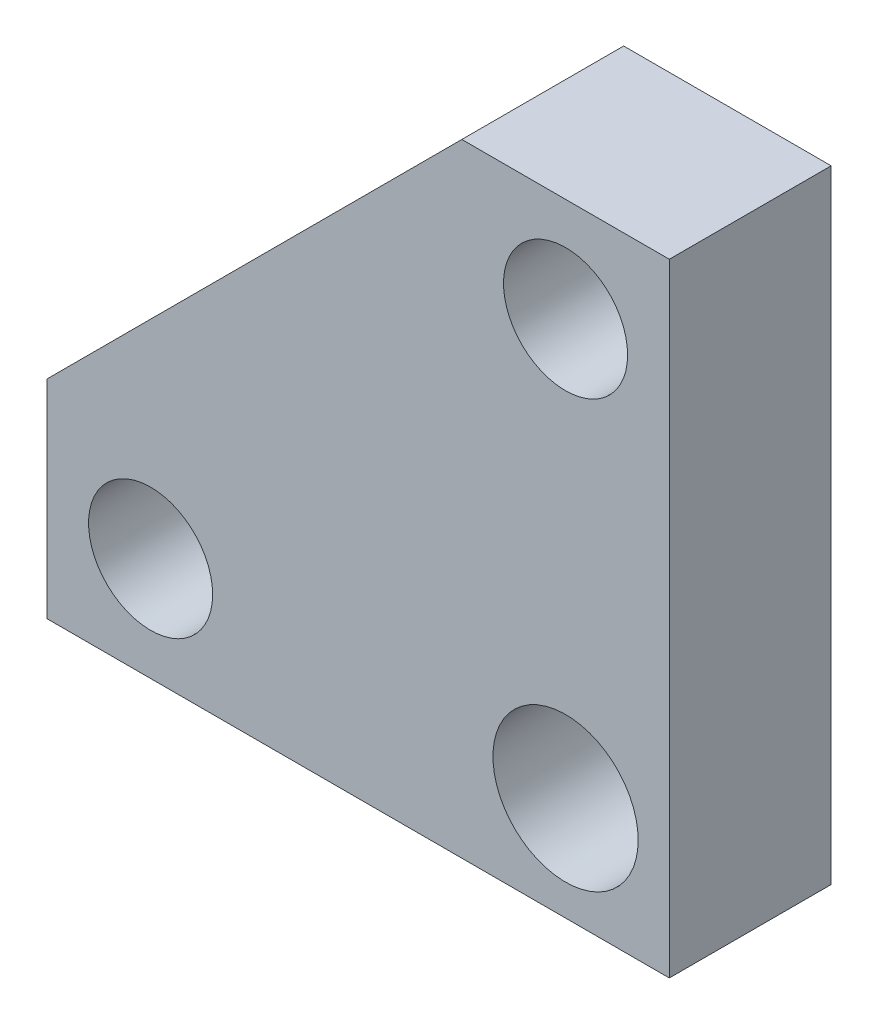
ISO-10303-21;
HEADER;
FILE_DESCRIPTION(('STEP AP214'),'2;1');
FILE_NAME('part.step','',(''),(''),'','','');
FILE_SCHEMA(('AUTOMOTIVE_DESIGN { 1 0 10303 214 1 1 1 1 }'));
ENDSEC;
DATA;
#1=APPLICATION_CONTEXT('core data for automotive mechanical design processes');
#2=APPLICATION_PROTOCOL_DEFINITION('international standard','automotive_design',2000,#1);
#3=PRODUCT_CONTEXT('',#1,'mechanical');
#4=PRODUCT('Part','Part','',(#3));
#5=PRODUCT_RELATED_PRODUCT_CATEGORY('part','',(#4));
#6=PRODUCT_DEFINITION_FORMATION('','',#4);
#7=PRODUCT_DEFINITION_CONTEXT('part definition',#1,'design');
#8=PRODUCT_DEFINITION('design','',#6,#7);
#9=PRODUCT_DEFINITION_SHAPE('','',#8);
#10=(LENGTH_UNIT() NAMED_UNIT(*) SI_UNIT(.MILLI.,.METRE.));
#11=(NAMED_UNIT(*) PLANE_ANGLE_UNIT() SI_UNIT($,.RADIAN.));
#12=(NAMED_UNIT(*) SI_UNIT($,.STERADIAN.) SOLID_ANGLE_UNIT());
#13=UNCERTAINTY_MEASURE_WITH_UNIT(LENGTH_MEASURE(1.E-05),#10,'distance_accuracy_value','');
#14=(GEOMETRIC_REPRESENTATION_CONTEXT(3) GLOBAL_UNCERTAINTY_ASSIGNED_CONTEXT((#13)) GLOBAL_UNIT_ASSIGNED_CONTEXT((#10,
#11,#12)) REPRESENTATION_CONTEXT('',''));
#15=CARTESIAN_POINT('',(0.,0.,0.));
#16=DIRECTION('',(0.,0.,1.));
#17=DIRECTION('',(1.,0.,0.));
#18=AXIS2_PLACEMENT_3D('',#15,#16,#17);
#19=CARTESIAN_POINT('',(0.,0.,3.9));
#20=DIRECTION('',(0.,0.,1.));
#21=DIRECTION('',(1.,0.,0.));
#22=AXIS2_PLACEMENT_3D('',#19,#20,#21);
#23=PLANE('',#22);
#24=CARTESIAN_POINT('',(-25.,5.,3.9));
#25=DIRECTION('',(0.,0.,1.));
#26=DIRECTION('',(1.,0.,0.));
#27=AXIS2_PLACEMENT_3D('',#24,#25,#26);
#28=CIRCLE('',#27,2.99);
#29=CARTESIAN_POINT('',(-22.01,5.,3.9));
#30=VERTEX_POINT('',#29);
#31=EDGE_CURVE('E141',#30,#30,#28,.T.);
#32=ORIENTED_EDGE('',*,*,#31,.F.);
#33=EDGE_LOOP('',(#32));
#34=FACE_BOUND('',#33,.T.);
#35=DIRECTION('',(1.,0.,0.));
#36=VECTOR('',#35,1.);
#37=CARTESIAN_POINT('',(-30.,0.,3.9));
#38=LINE('',#37,#36);
#39=CARTESIAN_POINT('',(-30.,0.,3.9));
#40=VERTEX_POINT('',#39);
#41=CARTESIAN_POINT('',(0.,0.,3.9));
#42=VERTEX_POINT('',#41);
#43=EDGE_CURVE('E110',#40,#42,#38,.T.);
#44=ORIENTED_EDGE('',*,*,#43,.T.);
#45=DIRECTION('',(0.,1.,0.));
#46=VECTOR('',#45,1.);
#47=CARTESIAN_POINT('',(0.,0.,3.9));
#48=LINE('',#47,#46);
#49=CARTESIAN_POINT('',(0.,30.,3.9));
#50=VERTEX_POINT('',#49);
#51=EDGE_CURVE('E93',#42,#50,#48,.T.);
#52=ORIENTED_EDGE('',*,*,#51,.T.);
#53=DIRECTION('',(-1.,0.,0.));
#54=VECTOR('',#53,1.);
#55=CARTESIAN_POINT('',(0.,30.,3.9));
#56=LINE('',#55,#54);
#57=CARTESIAN_POINT('',(-10.,30.,3.9));
#58=VERTEX_POINT('',#57);
#59=EDGE_CURVE('E113',#50,#58,#56,.T.);
#60=ORIENTED_EDGE('',*,*,#59,.T.);
#61=DIRECTION('',(-0.707106781186548,-0.707106781186548,0.));
#62=VECTOR('',#61,1.);
#63=CARTESIAN_POINT('',(-10.,30.,3.9));
#64=LINE('',#63,#62);
#65=CARTESIAN_POINT('',(-30.,10.,3.9));
#66=VERTEX_POINT('',#65);
#67=EDGE_CURVE('E52',#58,#66,#64,.T.);
#68=ORIENTED_EDGE('',*,*,#67,.T.);
#69=DIRECTION('',(0.,-1.,0.));
#70=VECTOR('',#69,1.);
#71=CARTESIAN_POINT('',(-30.,10.,3.9));
#72=LINE('',#71,#70);
#73=EDGE_CURVE('E47',#66,#40,#72,.T.);
#74=ORIENTED_EDGE('',*,*,#73,.T.);
#75=EDGE_LOOP('',(#44,#52,#60,#68,#74));
#76=FACE_BOUND('',#75,.T.);
#77=CARTESIAN_POINT('',(-5.,25.,3.9));
#78=DIRECTION('',(0.,0.,1.));
#79=DIRECTION('',(1.,0.,0.));
#80=AXIS2_PLACEMENT_3D('',#77,#78,#79);
#81=CIRCLE('',#80,2.99);
#82=CARTESIAN_POINT('',(-2.01,25.,3.9));
#83=VERTEX_POINT('',#82);
#84=EDGE_CURVE('E98',#83,#83,#81,.T.);
#85=ORIENTED_EDGE('',*,*,#84,.F.);
#86=EDGE_LOOP('',(#85));
#87=FACE_BOUND('',#86,.T.);
#88=CARTESIAN_POINT('',(-5.,5.,3.9));
#89=DIRECTION('',(0.,0.,1.));
#90=DIRECTION('',(1.,0.,0.));
#91=AXIS2_PLACEMENT_3D('',#88,#89,#90);
#92=CIRCLE('',#91,3.5);
#93=CARTESIAN_POINT('',(-1.5,5.,3.9));
#94=VERTEX_POINT('',#93);
#95=EDGE_CURVE('E135',#94,#94,#92,.T.);
#96=ORIENTED_EDGE('',*,*,#95,.F.);
#97=EDGE_LOOP('',(#96));
#98=FACE_BOUND('',#97,.T.);
#99=ADVANCED_FACE('F32',(#34,#76,#87,#98),#23,.T.);
#100=CARTESIAN_POINT('',(0.,0.,-3.9));
#101=DIRECTION('',(0.,0.,1.));
#102=DIRECTION('',(1.,0.,0.));
#103=AXIS2_PLACEMENT_3D('',#100,#101,#102);
#104=PLANE('',#103);
#105=CARTESIAN_POINT('',(-25.,5.,-3.9));
#106=DIRECTION('',(0.,0.,1.));
#107=DIRECTION('',(1.,0.,0.));
#108=AXIS2_PLACEMENT_3D('',#105,#106,#107);
#109=CIRCLE('',#108,2.99);
#110=CARTESIAN_POINT('',(-22.01,5.,-3.9));
#111=VERTEX_POINT('',#110);
#112=EDGE_CURVE('E137',#111,#111,#109,.T.);
#113=ORIENTED_EDGE('',*,*,#112,.T.);
#114=EDGE_LOOP('',(#113));
#115=FACE_BOUND('',#114,.T.);
#116=DIRECTION('',(1.,0.,0.));
#117=VECTOR('',#116,1.);
#118=CARTESIAN_POINT('',(-30.,0.,-3.9));
#119=LINE('',#118,#117);
#120=CARTESIAN_POINT('',(-30.,0.,-3.9));
#121=VERTEX_POINT('',#120);
#122=CARTESIAN_POINT('',(0.,0.,-3.9));
#123=VERTEX_POINT('',#122);
#124=EDGE_CURVE('E84',#121,#123,#119,.T.);
#125=ORIENTED_EDGE('',*,*,#124,.F.);
#126=DIRECTION('',(0.,-1.,0.));
#127=VECTOR('',#126,1.);
#128=CARTESIAN_POINT('',(-30.,10.,-3.9));
#129=LINE('',#128,#127);
#130=CARTESIAN_POINT('',(-30.,10.,-3.9));
#131=VERTEX_POINT('',#130);
#132=EDGE_CURVE('E108',#131,#121,#129,.T.);
#133=ORIENTED_EDGE('',*,*,#132,.F.);
#134=DIRECTION('',(-0.707106781186548,-0.707106781186548,0.));
#135=VECTOR('',#134,1.);
#136=CARTESIAN_POINT('',(-10.,30.,-3.9));
#137=LINE('',#136,#135);
#138=CARTESIAN_POINT('',(-10.,30.,-3.9));
#139=VERTEX_POINT('',#138);
#140=EDGE_CURVE('E106',#139,#131,#137,.T.);
#141=ORIENTED_EDGE('',*,*,#140,.F.);
#142=DIRECTION('',(-1.,0.,0.));
#143=VECTOR('',#142,1.);
#144=CARTESIAN_POINT('',(0.,30.,-3.9));
#145=LINE('',#144,#143);
#146=CARTESIAN_POINT('',(0.,30.,-3.9));
#147=VERTEX_POINT('',#146);
#148=EDGE_CURVE('E86',#147,#139,#145,.T.);
#149=ORIENTED_EDGE('',*,*,#148,.F.);
#150=DIRECTION('',(0.,1.,0.));
#151=VECTOR('',#150,1.);
#152=CARTESIAN_POINT('',(0.,0.,-3.9));
#153=LINE('',#152,#151);
#154=EDGE_CURVE('E79',#123,#147,#153,.T.);
#155=ORIENTED_EDGE('',*,*,#154,.F.);
#156=EDGE_LOOP('',(#125,#133,#141,#149,#155));
#157=FACE_BOUND('',#156,.T.);
#158=CARTESIAN_POINT('',(-5.,25.,-3.9));
#159=DIRECTION('',(0.,0.,1.));
#160=DIRECTION('',(1.,0.,0.));
#161=AXIS2_PLACEMENT_3D('',#158,#159,#160);
#162=CIRCLE('',#161,2.99);
#163=CARTESIAN_POINT('',(-2.01,25.,-3.9));
#164=VERTEX_POINT('',#163);
#165=EDGE_CURVE('E101',#164,#164,#162,.T.);
#166=ORIENTED_EDGE('',*,*,#165,.T.);
#167=EDGE_LOOP('',(#166));
#168=FACE_BOUND('',#167,.T.);
#169=CARTESIAN_POINT('',(-5.,5.,-3.9));
#170=DIRECTION('',(0.,0.,1.));
#171=DIRECTION('',(1.,0.,0.));
#172=AXIS2_PLACEMENT_3D('',#169,#170,#171);
#173=CIRCLE('',#172,3.5);
#174=CARTESIAN_POINT('',(-1.5,5.,-3.9));
#175=VERTEX_POINT('',#174);
#176=EDGE_CURVE('E138',#175,#175,#173,.T.);
#177=ORIENTED_EDGE('',*,*,#176,.T.);
#178=EDGE_LOOP('',(#177));
#179=FACE_BOUND('',#178,.T.);
#180=ADVANCED_FACE('F80',(#115,#157,#168,#179),#104,.F.);
#181=CARTESIAN_POINT('',(-30.,0.,3.9));
#182=DIRECTION('',(0.,1.,0.));
#183=DIRECTION('',(0.,0.,1.));
#184=AXIS2_PLACEMENT_3D('',#181,#182,#183);
#185=PLANE('',#184);
#186=ORIENTED_EDGE('',*,*,#124,.T.);
#187=DIRECTION('',(0.,0.,-1.));
#188=VECTOR('',#187,1.);
#189=CARTESIAN_POINT('',(0.,0.,3.9));
#190=LINE('',#189,#188);
#191=EDGE_CURVE('E11',#42,#123,#190,.T.);
#192=ORIENTED_EDGE('',*,*,#191,.F.);
#193=ORIENTED_EDGE('',*,*,#43,.F.);
#194=DIRECTION('',(0.,0.,-1.));
#195=VECTOR('',#194,1.);
#196=CARTESIAN_POINT('',(-30.,0.,3.9));
#197=LINE('',#196,#195);
#198=EDGE_CURVE('E97',#40,#121,#197,.T.);
#199=ORIENTED_EDGE('',*,*,#198,.T.);
#200=EDGE_LOOP('',(#186,#192,#193,#199));
#201=FACE_BOUND('',#200,.T.);
#202=ADVANCED_FACE('F34',(#201),#185,.F.);
#203=CARTESIAN_POINT('',(0.,0.,3.9));
#204=DIRECTION('',(-1.,0.,0.));
#205=DIRECTION('',(0.,0.,1.));
#206=AXIS2_PLACEMENT_3D('',#203,#204,#205);
#207=PLANE('',#206);
#208=ORIENTED_EDGE('',*,*,#154,.T.);
#209=DIRECTION('',(0.,0.,-1.));
#210=VECTOR('',#209,1.);
#211=CARTESIAN_POINT('',(0.,30.,3.9));
#212=LINE('',#211,#210);
#213=EDGE_CURVE('E40',#50,#147,#212,.T.);
#214=ORIENTED_EDGE('',*,*,#213,.F.);
#215=ORIENTED_EDGE('',*,*,#51,.F.);
#216=ORIENTED_EDGE('',*,*,#191,.T.);
#217=EDGE_LOOP('',(#208,#214,#215,#216));
#218=FACE_BOUND('',#217,.T.);
#219=ADVANCED_FACE('F92',(#218),#207,.F.);
#220=CARTESIAN_POINT('',(0.,30.,3.9));
#221=DIRECTION('',(0.,-1.,0.));
#222=DIRECTION('',(0.,0.,-1.));
#223=AXIS2_PLACEMENT_3D('',#220,#221,#222);
#224=PLANE('',#223);
#225=ORIENTED_EDGE('',*,*,#148,.T.);
#226=DIRECTION('',(0.,0.,-1.));
#227=VECTOR('',#226,1.);
#228=CARTESIAN_POINT('',(-10.,30.,3.9));
#229=LINE('',#228,#227);
#230=EDGE_CURVE('E121',#58,#139,#229,.T.);
#231=ORIENTED_EDGE('',*,*,#230,.F.);
#232=ORIENTED_EDGE('',*,*,#59,.F.);
#233=ORIENTED_EDGE('',*,*,#213,.T.);
#234=EDGE_LOOP('',(#225,#231,#232,#233));
#235=FACE_BOUND('',#234,.T.);
#236=ADVANCED_FACE('F125',(#235),#224,.F.);
#237=CARTESIAN_POINT('',(-10.,30.,3.9));
#238=DIRECTION('',(0.707106781186547,-0.707106781186547,0.));
#239=DIRECTION('',(0.707106781186548,0.707106781186548,0.));
#240=AXIS2_PLACEMENT_3D('',#237,#238,#239);
#241=PLANE('',#240);
#242=ORIENTED_EDGE('',*,*,#140,.T.);
#243=DIRECTION('',(0.,0.,-1.));
#244=VECTOR('',#243,1.);
#245=CARTESIAN_POINT('',(-30.,10.,3.9));
#246=LINE('',#245,#244);
#247=EDGE_CURVE('E118',#66,#131,#246,.T.);
#248=ORIENTED_EDGE('',*,*,#247,.F.);
#249=ORIENTED_EDGE('',*,*,#67,.F.);
#250=ORIENTED_EDGE('',*,*,#230,.T.);
#251=EDGE_LOOP('',(#242,#248,#249,#250));
#252=FACE_BOUND('',#251,.T.);
#253=ADVANCED_FACE('F164',(#252),#241,.F.);
#254=CARTESIAN_POINT('',(-30.,10.,3.9));
#255=DIRECTION('',(1.,0.,0.));
#256=DIRECTION('',(0.,0.,-1.));
#257=AXIS2_PLACEMENT_3D('',#254,#255,#256);
#258=PLANE('',#257);
#259=ORIENTED_EDGE('',*,*,#132,.T.);
#260=ORIENTED_EDGE('',*,*,#198,.F.);
#261=ORIENTED_EDGE('',*,*,#73,.F.);
#262=ORIENTED_EDGE('',*,*,#247,.T.);
#263=EDGE_LOOP('',(#259,#260,#261,#262));
#264=FACE_BOUND('',#263,.T.);
#265=ADVANCED_FACE('F154',(#264),#258,.F.);
#266=CARTESIAN_POINT('',(-5.,25.,3.9));
#267=DIRECTION('',(0.,0.,-1.));
#268=DIRECTION('',(-1.,0.,0.));
#269=AXIS2_PLACEMENT_3D('',#266,#267,#268);
#270=CYLINDRICAL_SURFACE('',#269,2.99);
#271=ORIENTED_EDGE('',*,*,#84,.T.);
#272=EDGE_LOOP('',(#271));
#273=FACE_BOUND('',#272,.T.);
#274=ORIENTED_EDGE('',*,*,#165,.F.);
#275=EDGE_LOOP('',(#274));
#276=FACE_BOUND('',#275,.T.);
#277=ADVANCED_FACE('F151',(#273,#276),#270,.F.);
#278=CARTESIAN_POINT('',(-25.,5.,3.9));
#279=DIRECTION('',(0.,0.,-1.));
#280=DIRECTION('',(-1.,0.,0.));
#281=AXIS2_PLACEMENT_3D('',#278,#279,#280);
#282=CYLINDRICAL_SURFACE('',#281,2.99);
#283=ORIENTED_EDGE('',*,*,#31,.T.);
#284=EDGE_LOOP('',(#283));
#285=FACE_BOUND('',#284,.T.);
#286=ORIENTED_EDGE('',*,*,#112,.F.);
#287=EDGE_LOOP('',(#286));
#288=FACE_BOUND('',#287,.T.);
#289=ADVANCED_FACE('F153',(#285,#288),#282,.F.);
#290=CARTESIAN_POINT('',(-5.,5.,3.9));
#291=DIRECTION('',(0.,0.,-1.));
#292=DIRECTION('',(-1.,0.,0.));
#293=AXIS2_PLACEMENT_3D('',#290,#291,#292);
#294=CYLINDRICAL_SURFACE('',#293,3.5);
#295=ORIENTED_EDGE('',*,*,#95,.T.);
#296=EDGE_LOOP('',(#295));
#297=FACE_BOUND('',#296,.T.);
#298=ORIENTED_EDGE('',*,*,#176,.F.);
#299=EDGE_LOOP('',(#298));
#300=FACE_BOUND('',#299,.T.);
#301=ADVANCED_FACE('F161',(#297,#300),#294,.F.);
#302=CLOSED_SHELL('',(#99,#180,#202,#219,#236,#253,#265,#277,#289,#301));
#303=MANIFOLD_SOLID_BREP('B2',#302);
#304=ADVANCED_BREP_SHAPE_REPRESENTATION('',(#18,#303),#14);
#305=SHAPE_DEFINITION_REPRESENTATION(#9,#304);
ENDSEC;
END-ISO-10303-21;
